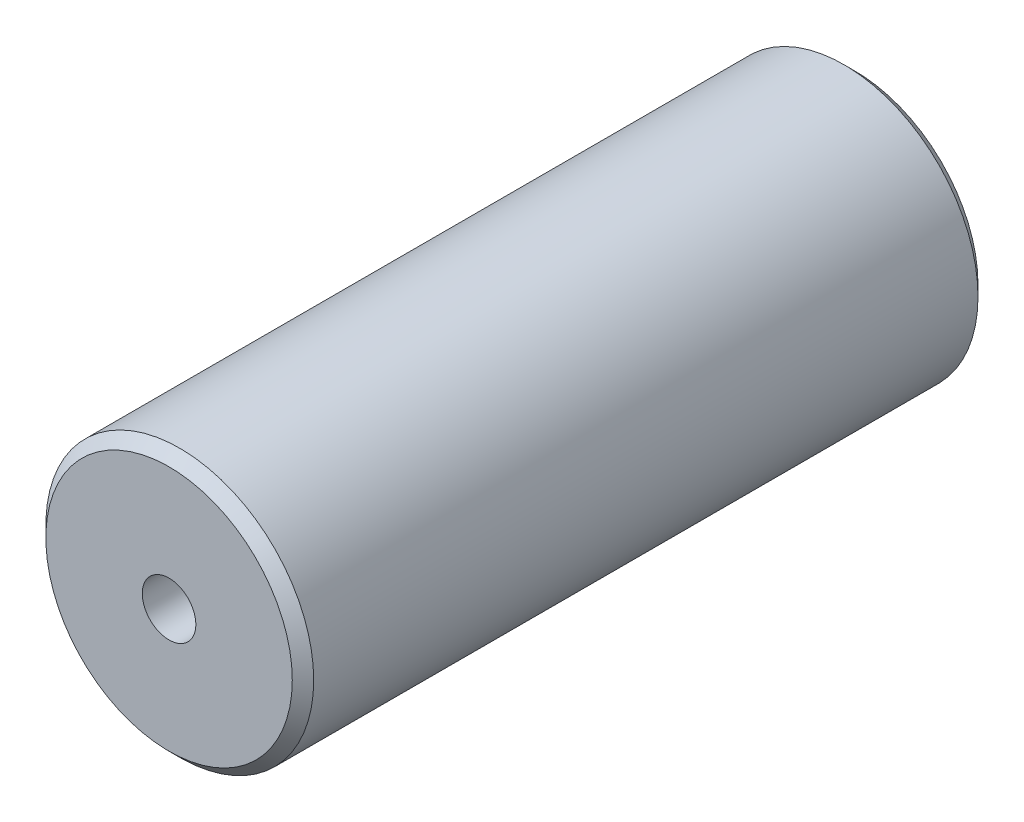
ISO-10303-21;
HEADER;
FILE_DESCRIPTION(('STEP AP214'),'2;1');
FILE_NAME('part.step','',(''),(''),'','','');
FILE_SCHEMA(('AUTOMOTIVE_DESIGN { 1 0 10303 214 1 1 1 1 }'));
ENDSEC;
DATA;
#1=APPLICATION_CONTEXT('core data for automotive mechanical design processes');
#2=APPLICATION_PROTOCOL_DEFINITION('international standard','automotive_design',2000,#1);
#3=PRODUCT_CONTEXT('',#1,'mechanical');
#4=PRODUCT('Part','Part','',(#3));
#5=PRODUCT_RELATED_PRODUCT_CATEGORY('part','',(#4));
#6=PRODUCT_DEFINITION_FORMATION('','',#4);
#7=PRODUCT_DEFINITION_CONTEXT('part definition',#1,'design');
#8=PRODUCT_DEFINITION('design','',#6,#7);
#9=PRODUCT_DEFINITION_SHAPE('','',#8);
#10=(LENGTH_UNIT() NAMED_UNIT(*) SI_UNIT(.MILLI.,.METRE.));
#11=(NAMED_UNIT(*) PLANE_ANGLE_UNIT() SI_UNIT($,.RADIAN.));
#12=(NAMED_UNIT(*) SI_UNIT($,.STERADIAN.) SOLID_ANGLE_UNIT());
#13=UNCERTAINTY_MEASURE_WITH_UNIT(LENGTH_MEASURE(1.E-05),#10,'distance_accuracy_value','');
#14=(GEOMETRIC_REPRESENTATION_CONTEXT(3) GLOBAL_UNCERTAINTY_ASSIGNED_CONTEXT((#13)) GLOBAL_UNIT_ASSIGNED_CONTEXT((#10,
#11,#12)) REPRESENTATION_CONTEXT('',''));
#15=CARTESIAN_POINT('',(0.,0.,0.));
#16=DIRECTION('',(0.,0.,1.));
#17=DIRECTION('',(1.,0.,0.));
#18=AXIS2_PLACEMENT_3D('',#15,#16,#17);
#19=CARTESIAN_POINT('',(0.,0.,32.));
#20=DIRECTION('',(0.,0.,-1.));
#21=DIRECTION('',(-1.,0.,0.));
#22=AXIS2_PLACEMENT_3D('',#19,#20,#21);
#23=CYLINDRICAL_SURFACE('',#22,12.5);
#24=CARTESIAN_POINT('',(0.,0.,-31.));
#25=DIRECTION('',(0.,0.,1.));
#26=DIRECTION('',(1.,0.,0.));
#27=AXIS2_PLACEMENT_3D('',#24,#25,#26);
#28=CIRCLE('',#27,12.5);
#29=CARTESIAN_POINT('',(12.5,0.,-31.));
#30=VERTEX_POINT('',#29);
#31=EDGE_CURVE('E75',#30,#30,#28,.T.);
#32=ORIENTED_EDGE('',*,*,#31,.T.);
#33=EDGE_LOOP('',(#32));
#34=FACE_BOUND('',#33,.T.);
#35=CARTESIAN_POINT('',(0.,0.,31.));
#36=DIRECTION('',(0.,0.,1.));
#37=DIRECTION('',(1.,0.,0.));
#38=AXIS2_PLACEMENT_3D('',#35,#36,#37);
#39=CIRCLE('',#38,12.5);
#40=CARTESIAN_POINT('',(12.5,0.,31.));
#41=VERTEX_POINT('',#40);
#42=EDGE_CURVE('E72',#41,#41,#39,.F.);
#43=ORIENTED_EDGE('',*,*,#42,.T.);
#44=EDGE_LOOP('',(#43));
#45=FACE_BOUND('',#44,.T.);
#46=ADVANCED_FACE('F36',(#34,#45),#23,.T.);
#47=CARTESIAN_POINT('',(0.,0.,32.));
#48=DIRECTION('',(0.,0.,1.));
#49=DIRECTION('',(1.,0.,0.));
#50=AXIS2_PLACEMENT_3D('',#47,#48,#49);
#51=PLANE('',#50);
#52=CARTESIAN_POINT('',(0.,0.,32.));
#53=DIRECTION('',(0.,0.,1.));
#54=DIRECTION('',(1.,0.,0.));
#55=AXIS2_PLACEMENT_3D('',#52,#53,#54);
#56=CIRCLE('',#55,2.49999999999999);
#57=CARTESIAN_POINT('',(2.49999999999999,0.,32.));
#58=VERTEX_POINT('',#57);
#59=EDGE_CURVE('E61',#58,#58,#56,.T.);
#60=ORIENTED_EDGE('',*,*,#59,.F.);
#61=EDGE_LOOP('',(#60));
#62=FACE_BOUND('',#61,.T.);
#63=CARTESIAN_POINT('',(0.,0.,32.));
#64=DIRECTION('',(0.,0.,1.));
#65=DIRECTION('',(1.,0.,0.));
#66=AXIS2_PLACEMENT_3D('',#63,#64,#65);
#67=CIRCLE('',#66,11.5);
#68=CARTESIAN_POINT('',(11.5,0.,32.));
#69=VERTEX_POINT('',#68);
#70=EDGE_CURVE('E11',#69,#69,#67,.T.);
#71=ORIENTED_EDGE('',*,*,#70,.T.);
#72=EDGE_LOOP('',(#71));
#73=FACE_BOUND('',#72,.T.);
#74=ADVANCED_FACE('F89',(#62,#73),#51,.T.);
#75=CARTESIAN_POINT('',(0.,0.,-32.));
#76=DIRECTION('',(0.,0.,1.));
#77=DIRECTION('',(1.,0.,0.));
#78=AXIS2_PLACEMENT_3D('',#75,#76,#77);
#79=PLANE('',#78);
#80=CARTESIAN_POINT('',(0.,0.,-32.));
#81=DIRECTION('',(0.,0.,-1.));
#82=DIRECTION('',(-1.,0.,0.));
#83=AXIS2_PLACEMENT_3D('',#80,#81,#82);
#84=CIRCLE('',#83,2.49999999999999);
#85=CARTESIAN_POINT('',(-2.49999999999999,0.,-32.));
#86=VERTEX_POINT('',#85);
#87=EDGE_CURVE('E62',#86,#86,#84,.T.);
#88=ORIENTED_EDGE('',*,*,#87,.F.);
#89=EDGE_LOOP('',(#88));
#90=FACE_BOUND('',#89,.T.);
#91=CARTESIAN_POINT('',(0.,0.,-32.));
#92=DIRECTION('',(0.,0.,1.));
#93=DIRECTION('',(1.,0.,0.));
#94=AXIS2_PLACEMENT_3D('',#91,#92,#93);
#95=CIRCLE('',#94,11.5);
#96=CARTESIAN_POINT('',(11.5,0.,-32.));
#97=VERTEX_POINT('',#96);
#98=EDGE_CURVE('E45',#97,#97,#95,.F.);
#99=ORIENTED_EDGE('',*,*,#98,.T.);
#100=EDGE_LOOP('',(#99));
#101=FACE_BOUND('',#100,.T.);
#102=ADVANCED_FACE('F80',(#90,#101),#79,.F.);
#103=CARTESIAN_POINT('',(0.,0.,-31.));
#104=DIRECTION('',(0.,0.,1.));
#105=DIRECTION('',(1.,0.,0.));
#106=AXIS2_PLACEMENT_3D('',#103,#104,#105);
#107=CONICAL_SURFACE('',#106,12.5,0.785398163397458);
#108=ORIENTED_EDGE('',*,*,#98,.F.);
#109=EDGE_LOOP('',(#108));
#110=FACE_BOUND('',#109,.T.);
#111=ORIENTED_EDGE('',*,*,#31,.F.);
#112=EDGE_LOOP('',(#111));
#113=FACE_BOUND('',#112,.T.);
#114=ADVANCED_FACE('F82',(#110,#113),#107,.T.);
#115=CARTESIAN_POINT('',(0.,0.,32.));
#116=DIRECTION('',(0.,0.,-1.));
#117=DIRECTION('',(-1.,0.,0.));
#118=AXIS2_PLACEMENT_3D('',#115,#116,#117);
#119=CONICAL_SURFACE('',#118,11.5,0.785398163397447);
#120=ORIENTED_EDGE('',*,*,#42,.F.);
#121=EDGE_LOOP('',(#120));
#122=FACE_BOUND('',#121,.T.);
#123=ORIENTED_EDGE('',*,*,#70,.F.);
#124=EDGE_LOOP('',(#123));
#125=FACE_BOUND('',#124,.T.);
#126=ADVANCED_FACE('F39',(#122,#125),#119,.T.);
#127=CARTESIAN_POINT('',(0.,0.,19.));
#128=DIRECTION('',(0.,0.,1.));
#129=DIRECTION('',(1.,0.,0.));
#130=AXIS2_PLACEMENT_3D('',#127,#128,#129);
#131=CONICAL_SURFACE('',#130,2.49999999999999,1.02974425867665);
#132=CARTESIAN_POINT('',(0.,0.,17.4978484524311));
#133=VERTEX_POINT('',#132);
#134=VERTEX_LOOP('',#133);
#135=FACE_BOUND('',#134,.T.);
#136=CARTESIAN_POINT('',(0.,0.,19.));
#137=DIRECTION('',(0.,0.,1.));
#138=DIRECTION('',(1.,0.,0.));
#139=AXIS2_PLACEMENT_3D('',#136,#137,#138);
#140=CIRCLE('',#139,2.49999999999999);
#141=CARTESIAN_POINT('',(2.49999999999999,0.,19.));
#142=VERTEX_POINT('',#141);
#143=EDGE_CURVE('E65',#142,#142,#140,.T.);
#144=ORIENTED_EDGE('',*,*,#143,.T.);
#145=EDGE_LOOP('',(#144));
#146=FACE_BOUND('',#145,.T.);
#147=ADVANCED_FACE('F95',(#135,#146),#131,.F.);
#148=CARTESIAN_POINT('',(0.,0.,32.));
#149=DIRECTION('',(0.,0.,1.));
#150=DIRECTION('',(1.,0.,0.));
#151=AXIS2_PLACEMENT_3D('',#148,#149,#150);
#152=CYLINDRICAL_SURFACE('',#151,2.49999999999999);
#153=ORIENTED_EDGE('',*,*,#143,.F.);
#154=EDGE_LOOP('',(#153));
#155=FACE_BOUND('',#154,.T.);
#156=ORIENTED_EDGE('',*,*,#59,.T.);
#157=EDGE_LOOP('',(#156));
#158=FACE_BOUND('',#157,.T.);
#159=ADVANCED_FACE('F55',(#155,#158),#152,.F.);
#160=CARTESIAN_POINT('',(0.,0.,-19.));
#161=DIRECTION('',(0.,0.,-1.));
#162=DIRECTION('',(-1.,0.,0.));
#163=AXIS2_PLACEMENT_3D('',#160,#161,#162);
#164=CONICAL_SURFACE('',#163,2.49999999999999,1.02974425867665);
#165=CARTESIAN_POINT('',(0.,0.,-17.4978484524311));
#166=VERTEX_POINT('',#165);
#167=VERTEX_LOOP('',#166);
#168=FACE_BOUND('',#167,.T.);
#169=CARTESIAN_POINT('',(0.,0.,-19.));
#170=DIRECTION('',(0.,0.,-1.));
#171=DIRECTION('',(-1.,0.,0.));
#172=AXIS2_PLACEMENT_3D('',#169,#170,#171);
#173=CIRCLE('',#172,2.49999999999999);
#174=CARTESIAN_POINT('',(-2.49999999999999,0.,-19.));
#175=VERTEX_POINT('',#174);
#176=EDGE_CURVE('E59',#175,#175,#173,.T.);
#177=ORIENTED_EDGE('',*,*,#176,.T.);
#178=EDGE_LOOP('',(#177));
#179=FACE_BOUND('',#178,.T.);
#180=ADVANCED_FACE('F51',(#168,#179),#164,.F.);
#181=CARTESIAN_POINT('',(0.,0.,-32.));
#182=DIRECTION('',(0.,0.,-1.));
#183=DIRECTION('',(-1.,0.,0.));
#184=AXIS2_PLACEMENT_3D('',#181,#182,#183);
#185=CYLINDRICAL_SURFACE('',#184,2.49999999999999);
#186=ORIENTED_EDGE('',*,*,#176,.F.);
#187=EDGE_LOOP('',(#186));
#188=FACE_BOUND('',#187,.T.);
#189=ORIENTED_EDGE('',*,*,#87,.T.);
#190=EDGE_LOOP('',(#189));
#191=FACE_BOUND('',#190,.T.);
#192=ADVANCED_FACE('F54',(#188,#191),#185,.F.);
#193=CLOSED_SHELL('',(#46,#74,#102,#114,#126,#147,#159,#180,#192));
#194=MANIFOLD_SOLID_BREP('B2',#193);
#195=ADVANCED_BREP_SHAPE_REPRESENTATION('',(#18,#194),#14);
#196=SHAPE_DEFINITION_REPRESENTATION(#9,#195);
ENDSEC;
END-ISO-10303-21;
